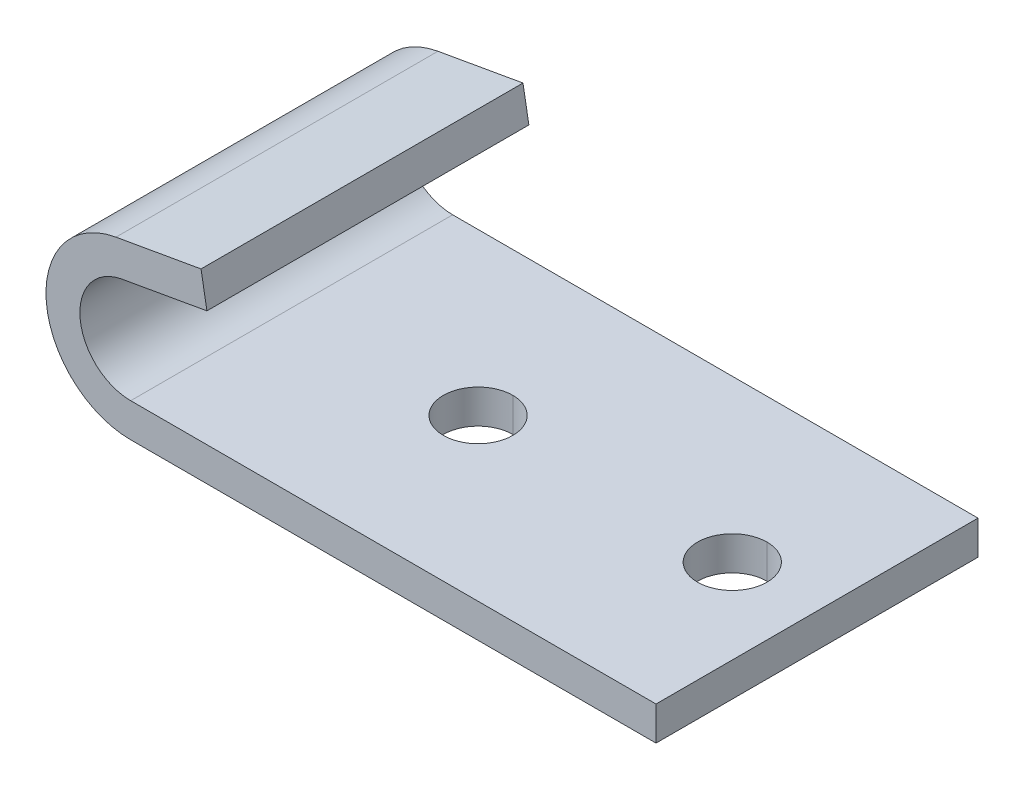
ISO-10303-21;
HEADER;
FILE_DESCRIPTION(('STEP AP214'),'2;1');
FILE_NAME('part.step','',(''),(''),'','','');
FILE_SCHEMA(('AUTOMOTIVE_DESIGN { 1 0 10303 214 1 1 1 1 }'));
ENDSEC;
DATA;
#1=APPLICATION_CONTEXT('core data for automotive mechanical design processes');
#2=APPLICATION_PROTOCOL_DEFINITION('international standard','automotive_design',2000,#1);
#3=PRODUCT_CONTEXT('',#1,'mechanical');
#4=PRODUCT('Part','Part','',(#3));
#5=PRODUCT_RELATED_PRODUCT_CATEGORY('part','',(#4));
#6=PRODUCT_DEFINITION_FORMATION('','',#4);
#7=PRODUCT_DEFINITION_CONTEXT('part definition',#1,'design');
#8=PRODUCT_DEFINITION('design','',#6,#7);
#9=PRODUCT_DEFINITION_SHAPE('','',#8);
#10=(LENGTH_UNIT() NAMED_UNIT(*) SI_UNIT(.MILLI.,.METRE.));
#11=(NAMED_UNIT(*) PLANE_ANGLE_UNIT() SI_UNIT($,.RADIAN.));
#12=(NAMED_UNIT(*) SI_UNIT($,.STERADIAN.) SOLID_ANGLE_UNIT());
#13=UNCERTAINTY_MEASURE_WITH_UNIT(LENGTH_MEASURE(1.E-05),#10,'distance_accuracy_value','');
#14=(GEOMETRIC_REPRESENTATION_CONTEXT(3) GLOBAL_UNCERTAINTY_ASSIGNED_CONTEXT((#13)) GLOBAL_UNIT_ASSIGNED_CONTEXT((#10,
#11,#12)) REPRESENTATION_CONTEXT('',''));
#15=CARTESIAN_POINT('',(0.,0.,0.));
#16=DIRECTION('',(0.,0.,1.));
#17=DIRECTION('',(1.,0.,0.));
#18=AXIS2_PLACEMENT_3D('',#15,#16,#17);
#19=CARTESIAN_POINT('',(20.150422440742,-1.1899254188708,9.5));
#20=DIRECTION('',(0.173859402032216,-0.984770485100463,0.));
#21=DIRECTION('',(0.984770485100463,0.173859402032216,0.));
#22=AXIS2_PLACEMENT_3D('',#19,#20,#21);
#23=PLANE('',#22);
#24=DIRECTION('',(-0.984770485100463,-0.173859402032216,0.));
#25=VECTOR('',#24,1.);
#26=CARTESIAN_POINT('',(20.150422440742,-1.1899254188708,-9.5));
#27=LINE('',#26,#25);
#28=CARTESIAN_POINT('',(20.150422440742,-1.1899254188708,-9.5));
#29=VERTEX_POINT('',#28);
#30=CARTESIAN_POINT('',(15.130702989839,-2.0761475744977,-9.5));
#31=VERTEX_POINT('',#30);
#32=EDGE_CURVE('E10',#29,#31,#27,.T.);
#33=ORIENTED_EDGE('',*,*,#32,.T.);
#34=DIRECTION('',(0.,0.,-1.));
#35=VECTOR('',#34,1.);
#36=CARTESIAN_POINT('',(15.130702989839,-2.0761475744977,9.5));
#37=LINE('',#36,#35);
#38=CARTESIAN_POINT('',(15.130702989839,-2.0761475744977,9.5));
#39=VERTEX_POINT('',#38);
#40=EDGE_CURVE('E23',#39,#31,#37,.T.);
#41=ORIENTED_EDGE('',*,*,#40,.F.);
#42=DIRECTION('',(-0.984770485100463,-0.173859402032216,0.));
#43=VECTOR('',#42,1.);
#44=CARTESIAN_POINT('',(20.150422440742,-1.1899254188708,9.5));
#45=LINE('',#44,#43);
#46=CARTESIAN_POINT('',(20.150422440742,-1.1899254188708,9.5));
#47=VERTEX_POINT('',#46);
#48=EDGE_CURVE('E229',#47,#39,#45,.T.);
#49=ORIENTED_EDGE('',*,*,#48,.F.);
#50=DIRECTION('',(0.,0.,-1.));
#51=VECTOR('',#50,1.);
#52=CARTESIAN_POINT('',(20.150422440742,-1.1899254188708,9.5));
#53=LINE('',#52,#51);
#54=EDGE_CURVE('E225',#47,#29,#53,.T.);
#55=ORIENTED_EDGE('',*,*,#54,.T.);
#56=EDGE_LOOP('',(#33,#41,#49,#55));
#57=FACE_BOUND('',#56,.T.);
#58=ADVANCED_FACE('F15',(#57),#23,.F.);
#59=CARTESIAN_POINT('',(20.497718804064,-3.1595409702009,9.5));
#60=DIRECTION('',(-0.984807753012249,-0.1736481776667,0.));
#61=DIRECTION('',(0.1736481776667,-0.984807753012249,0.));
#62=AXIS2_PLACEMENT_3D('',#59,#60,#61);
#63=PLANE('',#62);
#64=DIRECTION('',(-0.173648177666701,0.984807753012249,0.));
#65=VECTOR('',#64,1.);
#66=CARTESIAN_POINT('',(20.497718804064,-3.1595409702009,-9.5));
#67=LINE('',#66,#65);
#68=CARTESIAN_POINT('',(20.497718804064,-3.1595409702009,-9.5));
#69=VERTEX_POINT('',#68);
#70=EDGE_CURVE('E220',#69,#29,#67,.T.);
#71=ORIENTED_EDGE('',*,*,#70,.T.);
#72=ORIENTED_EDGE('',*,*,#54,.F.);
#73=DIRECTION('',(-0.173648177666701,0.984807753012249,0.));
#74=VECTOR('',#73,1.);
#75=CARTESIAN_POINT('',(20.497718804064,-3.1595409702009,9.5));
#76=LINE('',#75,#74);
#77=CARTESIAN_POINT('',(20.497718804064,-3.1595409702009,9.5));
#78=VERTEX_POINT('',#77);
#79=EDGE_CURVE('E215',#78,#47,#76,.T.);
#80=ORIENTED_EDGE('',*,*,#79,.F.);
#81=DIRECTION('',(0.,0.,-1.));
#82=VECTOR('',#81,1.);
#83=CARTESIAN_POINT('',(20.497718804064,-3.1595409702009,9.5));
#84=LINE('',#83,#82);
#85=EDGE_CURVE('E211',#78,#69,#84,.T.);
#86=ORIENTED_EDGE('',*,*,#85,.T.);
#87=EDGE_LOOP('',(#71,#72,#80,#86));
#88=FACE_BOUND('',#87,.T.);
#89=ADVANCED_FACE('F243',(#88),#63,.F.);
#90=CARTESIAN_POINT('',(15.478421793903,-4.0456885446986,9.5));
#91=DIRECTION('',(-0.17385940203222,0.984770485100462,0.));
#92=DIRECTION('',(-0.984770485100462,-0.17385940203222,0.));
#93=AXIS2_PLACEMENT_3D('',#90,#91,#92);
#94=PLANE('',#93);
#95=DIRECTION('',(0.984770485100462,0.17385940203222,0.));
#96=VECTOR('',#95,1.);
#97=CARTESIAN_POINT('',(15.478421793903,-4.0456885446986,-9.5));
#98=LINE('',#97,#96);
#99=CARTESIAN_POINT('',(15.478421793903,-4.0456885446986,-9.5));
#100=VERTEX_POINT('',#99);
#101=EDGE_CURVE('E206',#100,#69,#98,.T.);
#102=ORIENTED_EDGE('',*,*,#101,.T.);
#103=ORIENTED_EDGE('',*,*,#85,.F.);
#104=DIRECTION('',(0.984770485100462,0.17385940203222,0.));
#105=VECTOR('',#104,1.);
#106=CARTESIAN_POINT('',(15.478421793903,-4.0456885446986,9.5));
#107=LINE('',#106,#105);
#108=CARTESIAN_POINT('',(15.478421793903,-4.0456885446986,9.5));
#109=VERTEX_POINT('',#108);
#110=EDGE_CURVE('E201',#109,#78,#107,.T.);
#111=ORIENTED_EDGE('',*,*,#110,.F.);
#112=DIRECTION('',(0.,0.,-1.));
#113=VECTOR('',#112,1.);
#114=CARTESIAN_POINT('',(15.478421793903,-4.0456885446986,9.5));
#115=LINE('',#114,#113);
#116=EDGE_CURVE('E197',#109,#100,#115,.T.);
#117=ORIENTED_EDGE('',*,*,#116,.T.);
#118=EDGE_LOOP('',(#102,#103,#111,#117));
#119=FACE_BOUND('',#118,.T.);
#120=ADVANCED_FACE('F248',(#119),#94,.F.);
#121=CARTESIAN_POINT('',(15.9999999999997,-7.,9.5));
#122=DIRECTION('',(0.,0.,-1.));
#123=DIRECTION('',(0.996185346118096,0.0872625703241038,0.));
#124=AXIS2_PLACEMENT_3D('',#121,#122,#123);
#125=CYLINDRICAL_SURFACE('',#124,3.);
#126=CARTESIAN_POINT('',(15.9999999999997,-7.,-9.5));
#127=DIRECTION('',(0.,0.,1.));
#128=DIRECTION('',(1.,0.,0.));
#129=AXIS2_PLACEMENT_3D('',#126,#127,#128);
#130=CIRCLE('',#129,3.);
#131=CARTESIAN_POINT('',(16.,-10.,-9.5));
#132=VERTEX_POINT('',#131);
#133=EDGE_CURVE('E192',#100,#132,#130,.T.);
#134=ORIENTED_EDGE('',*,*,#133,.F.);
#135=ORIENTED_EDGE('',*,*,#116,.F.);
#136=CARTESIAN_POINT('',(15.9999999999997,-7.,9.5));
#137=DIRECTION('',(0.,0.,1.));
#138=DIRECTION('',(1.,0.,0.));
#139=AXIS2_PLACEMENT_3D('',#136,#137,#138);
#140=CIRCLE('',#139,3.);
#141=CARTESIAN_POINT('',(16.,-10.,9.5));
#142=VERTEX_POINT('',#141);
#143=EDGE_CURVE('E188',#109,#142,#140,.T.);
#144=ORIENTED_EDGE('',*,*,#143,.T.);
#145=DIRECTION('',(0.,0.,-1.));
#146=VECTOR('',#145,1.);
#147=CARTESIAN_POINT('',(16.,-10.,9.5));
#148=LINE('',#147,#146);
#149=EDGE_CURVE('E184',#142,#132,#148,.T.);
#150=ORIENTED_EDGE('',*,*,#149,.T.);
#151=EDGE_LOOP('',(#134,#135,#144,#150));
#152=FACE_BOUND('',#151,.T.);
#153=ADVANCED_FACE('F252',(#152),#125,.F.);
#154=CARTESIAN_POINT('',(47.,-10.,9.5));
#155=DIRECTION('',(0.,-1.,0.));
#156=DIRECTION('',(0.,0.,-1.));
#157=AXIS2_PLACEMENT_3D('',#154,#155,#156);
#158=PLANE('',#157);
#159=CARTESIAN_POINT('',(27.,-10.,0.));
#160=DIRECTION('',(0.,-1.,0.));
#161=DIRECTION('',(0.,0.,-1.));
#162=AXIS2_PLACEMENT_3D('',#159,#160,#161);
#163=CIRCLE('',#162,2.05);
#164=CARTESIAN_POINT('',(27.,-10.,-2.05));
#165=VERTEX_POINT('',#164);
#166=CARTESIAN_POINT('',(27.,-10.,2.05));
#167=VERTEX_POINT('',#166);
#168=EDGE_CURVE('E180',#165,#167,#163,.T.);
#169=ORIENTED_EDGE('',*,*,#168,.T.);
#170=CARTESIAN_POINT('',(27.,-10.,0.));
#171=DIRECTION('',(0.,-1.,0.));
#172=DIRECTION('',(0.,0.,-1.));
#173=AXIS2_PLACEMENT_3D('',#170,#171,#172);
#174=CIRCLE('',#173,2.05);
#175=EDGE_CURVE('E176',#167,#165,#174,.T.);
#176=ORIENTED_EDGE('',*,*,#175,.T.);
#177=EDGE_LOOP('',(#169,#176));
#178=FACE_BOUND('',#177,.T.);
#179=CARTESIAN_POINT('',(42.,-10.,0.));
#180=DIRECTION('',(0.,-1.,0.));
#181=DIRECTION('',(0.,0.,-1.));
#182=AXIS2_PLACEMENT_3D('',#179,#180,#181);
#183=CIRCLE('',#182,2.05);
#184=CARTESIAN_POINT('',(42.,-10.,-2.05));
#185=VERTEX_POINT('',#184);
#186=CARTESIAN_POINT('',(42.,-10.,2.05));
#187=VERTEX_POINT('',#186);
#188=EDGE_CURVE('E172',#185,#187,#183,.T.);
#189=ORIENTED_EDGE('',*,*,#188,.T.);
#190=CARTESIAN_POINT('',(42.,-10.,0.));
#191=DIRECTION('',(0.,-1.,0.));
#192=DIRECTION('',(0.,0.,-1.));
#193=AXIS2_PLACEMENT_3D('',#190,#191,#192);
#194=CIRCLE('',#193,2.05);
#195=EDGE_CURVE('E168',#187,#185,#194,.T.);
#196=ORIENTED_EDGE('',*,*,#195,.T.);
#197=EDGE_LOOP('',(#189,#196));
#198=FACE_BOUND('',#197,.T.);
#199=DIRECTION('',(-1.,0.,0.));
#200=VECTOR('',#199,1.);
#201=CARTESIAN_POINT('',(47.,-10.,-9.5));
#202=LINE('',#201,#200);
#203=CARTESIAN_POINT('',(47.,-10.,-9.5));
#204=VERTEX_POINT('',#203);
#205=EDGE_CURVE('E163',#204,#132,#202,.T.);
#206=ORIENTED_EDGE('',*,*,#205,.T.);
#207=ORIENTED_EDGE('',*,*,#149,.F.);
#208=DIRECTION('',(-1.,0.,0.));
#209=VECTOR('',#208,1.);
#210=CARTESIAN_POINT('',(47.,-10.,9.5));
#211=LINE('',#210,#209);
#212=CARTESIAN_POINT('',(47.,-10.,9.5));
#213=VERTEX_POINT('',#212);
#214=EDGE_CURVE('E158',#213,#142,#211,.T.);
#215=ORIENTED_EDGE('',*,*,#214,.F.);
#216=DIRECTION('',(0.,0.,-1.));
#217=VECTOR('',#216,1.);
#218=CARTESIAN_POINT('',(47.,-10.,9.5));
#219=LINE('',#218,#217);
#220=EDGE_CURVE('E154',#213,#204,#219,.T.);
#221=ORIENTED_EDGE('',*,*,#220,.T.);
#222=EDGE_LOOP('',(#206,#207,#215,#221));
#223=FACE_BOUND('',#222,.T.);
#224=ADVANCED_FACE('F255',(#178,#198,#223),#158,.F.);
#225=CARTESIAN_POINT('',(47.,-12.,9.5));
#226=DIRECTION('',(-1.,0.,0.));
#227=DIRECTION('',(0.,0.,1.));
#228=AXIS2_PLACEMENT_3D('',#225,#226,#227);
#229=PLANE('',#228);
#230=DIRECTION('',(0.,1.,0.));
#231=VECTOR('',#230,1.);
#232=CARTESIAN_POINT('',(47.,-12.,-9.5));
#233=LINE('',#232,#231);
#234=CARTESIAN_POINT('',(47.,-12.,-9.5));
#235=VERTEX_POINT('',#234);
#236=EDGE_CURVE('E120',#235,#204,#233,.T.);
#237=ORIENTED_EDGE('',*,*,#236,.T.);
#238=ORIENTED_EDGE('',*,*,#220,.F.);
#239=DIRECTION('',(0.,1.,0.));
#240=VECTOR('',#239,1.);
#241=CARTESIAN_POINT('',(47.,-12.,9.5));
#242=LINE('',#241,#240);
#243=CARTESIAN_POINT('',(47.,-12.,9.5));
#244=VERTEX_POINT('',#243);
#245=EDGE_CURVE('E146',#244,#213,#242,.T.);
#246=ORIENTED_EDGE('',*,*,#245,.F.);
#247=DIRECTION('',(0.,0.,-1.));
#248=VECTOR('',#247,1.);
#249=CARTESIAN_POINT('',(47.,-12.,9.5));
#250=LINE('',#249,#248);
#251=EDGE_CURVE('E142',#244,#235,#250,.T.);
#252=ORIENTED_EDGE('',*,*,#251,.T.);
#253=EDGE_LOOP('',(#237,#238,#246,#252));
#254=FACE_BOUND('',#253,.T.);
#255=ADVANCED_FACE('F258',(#254),#229,.F.);
#256=CARTESIAN_POINT('',(16.,-12.,9.5));
#257=DIRECTION('',(0.,1.,0.));
#258=DIRECTION('',(0.,0.,1.));
#259=AXIS2_PLACEMENT_3D('',#256,#257,#258);
#260=PLANE('',#259);
#261=CARTESIAN_POINT('',(27.,-12.,0.));
#262=DIRECTION('',(0.,1.,0.));
#263=DIRECTION('',(0.,0.,1.));
#264=AXIS2_PLACEMENT_3D('',#261,#262,#263);
#265=CIRCLE('',#264,2.05);
#266=CARTESIAN_POINT('',(27.,-12.,2.05));
#267=VERTEX_POINT('',#266);
#268=CARTESIAN_POINT('',(27.,-12.,-2.05));
#269=VERTEX_POINT('',#268);
#270=EDGE_CURVE('E138',#267,#269,#265,.T.);
#271=ORIENTED_EDGE('',*,*,#270,.T.);
#272=CARTESIAN_POINT('',(27.,-12.,0.));
#273=DIRECTION('',(0.,1.,0.));
#274=DIRECTION('',(0.,0.,1.));
#275=AXIS2_PLACEMENT_3D('',#272,#273,#274);
#276=CIRCLE('',#275,2.05);
#277=EDGE_CURVE('E134',#269,#267,#276,.T.);
#278=ORIENTED_EDGE('',*,*,#277,.T.);
#279=EDGE_LOOP('',(#271,#278));
#280=FACE_BOUND('',#279,.T.);
#281=CARTESIAN_POINT('',(42.,-12.,0.));
#282=DIRECTION('',(0.,1.,0.));
#283=DIRECTION('',(0.,0.,1.));
#284=AXIS2_PLACEMENT_3D('',#281,#282,#283);
#285=CIRCLE('',#284,2.05);
#286=CARTESIAN_POINT('',(42.,-12.,2.05));
#287=VERTEX_POINT('',#286);
#288=CARTESIAN_POINT('',(42.,-12.,-2.05));
#289=VERTEX_POINT('',#288);
#290=EDGE_CURVE('E123',#287,#289,#285,.T.);
#291=ORIENTED_EDGE('',*,*,#290,.T.);
#292=CARTESIAN_POINT('',(42.,-12.,0.));
#293=DIRECTION('',(0.,1.,0.));
#294=DIRECTION('',(0.,0.,1.));
#295=AXIS2_PLACEMENT_3D('',#292,#293,#294);
#296=CIRCLE('',#295,2.05);
#297=EDGE_CURVE('E121',#289,#287,#296,.T.);
#298=ORIENTED_EDGE('',*,*,#297,.T.);
#299=EDGE_LOOP('',(#291,#298));
#300=FACE_BOUND('',#299,.T.);
#301=DIRECTION('',(1.,0.,0.));
#302=VECTOR('',#301,1.);
#303=CARTESIAN_POINT('',(16.,-12.,-9.5));
#304=LINE('',#303,#302);
#305=CARTESIAN_POINT('',(16.,-12.,-9.5));
#306=VERTEX_POINT('',#305);
#307=EDGE_CURVE('E105',#306,#235,#304,.T.);
#308=ORIENTED_EDGE('',*,*,#307,.T.);
#309=ORIENTED_EDGE('',*,*,#251,.F.);
#310=DIRECTION('',(1.,0.,0.));
#311=VECTOR('',#310,1.);
#312=CARTESIAN_POINT('',(16.,-12.,9.5));
#313=LINE('',#312,#311);
#314=CARTESIAN_POINT('',(16.,-12.,9.5));
#315=VERTEX_POINT('',#314);
#316=EDGE_CURVE('E108',#315,#244,#313,.T.);
#317=ORIENTED_EDGE('',*,*,#316,.F.);
#318=DIRECTION('',(0.,0.,-1.));
#319=VECTOR('',#318,1.);
#320=CARTESIAN_POINT('',(16.,-12.,9.5));
#321=LINE('',#320,#319);
#322=EDGE_CURVE('E100',#315,#306,#321,.T.);
#323=ORIENTED_EDGE('',*,*,#322,.T.);
#324=EDGE_LOOP('',(#308,#309,#317,#323));
#325=FACE_BOUND('',#324,.T.);
#326=ADVANCED_FACE('F102',(#280,#300,#325),#260,.F.);
#327=CARTESIAN_POINT('',(16.,-7.,9.5));
#328=DIRECTION('',(0.,0.,-1.));
#329=DIRECTION('',(0.996185346118102,0.0872625703240375,0.));
#330=AXIS2_PLACEMENT_3D('',#327,#328,#329);
#331=CYLINDRICAL_SURFACE('',#330,5.);
#332=CARTESIAN_POINT('',(16.,-7.,-9.5));
#333=DIRECTION('',(0.,0.,1.));
#334=DIRECTION('',(1.,0.,0.));
#335=AXIS2_PLACEMENT_3D('',#332,#333,#334);
#336=CIRCLE('',#335,5.);
#337=EDGE_CURVE('E111',#31,#306,#336,.T.);
#338=ORIENTED_EDGE('',*,*,#337,.T.);
#339=ORIENTED_EDGE('',*,*,#322,.F.);
#340=CARTESIAN_POINT('',(16.,-7.,9.5));
#341=DIRECTION('',(0.,0.,1.));
#342=DIRECTION('',(1.,0.,0.));
#343=AXIS2_PLACEMENT_3D('',#340,#341,#342);
#344=CIRCLE('',#343,5.);
#345=EDGE_CURVE('E115',#39,#315,#344,.T.);
#346=ORIENTED_EDGE('',*,*,#345,.F.);
#347=ORIENTED_EDGE('',*,*,#40,.T.);
#348=EDGE_LOOP('',(#338,#339,#346,#347));
#349=FACE_BOUND('',#348,.T.);
#350=ADVANCED_FACE('F113',(#349),#331,.T.);
#351=CARTESIAN_POINT('',(16.,-7.,9.5));
#352=DIRECTION('',(0.,0.,1.));
#353=DIRECTION('',(1.,0.,0.));
#354=AXIS2_PLACEMENT_3D('',#351,#352,#353);
#355=PLANE('',#354);
#356=ORIENTED_EDGE('',*,*,#48,.T.);
#357=ORIENTED_EDGE('',*,*,#345,.T.);
#358=ORIENTED_EDGE('',*,*,#316,.T.);
#359=ORIENTED_EDGE('',*,*,#245,.T.);
#360=ORIENTED_EDGE('',*,*,#214,.T.);
#361=ORIENTED_EDGE('',*,*,#143,.F.);
#362=ORIENTED_EDGE('',*,*,#110,.T.);
#363=ORIENTED_EDGE('',*,*,#79,.T.);
#364=EDGE_LOOP('',(#356,#357,#358,#359,#360,#361,#362,#363));
#365=FACE_BOUND('',#364,.T.);
#366=ADVANCED_FACE('F239',(#365),#355,.T.);
#367=CARTESIAN_POINT('',(16.,-7.,-9.5));
#368=DIRECTION('',(0.,0.,1.));
#369=DIRECTION('',(1.,0.,0.));
#370=AXIS2_PLACEMENT_3D('',#367,#368,#369);
#371=PLANE('',#370);
#372=ORIENTED_EDGE('',*,*,#32,.F.);
#373=ORIENTED_EDGE('',*,*,#70,.F.);
#374=ORIENTED_EDGE('',*,*,#101,.F.);
#375=ORIENTED_EDGE('',*,*,#133,.T.);
#376=ORIENTED_EDGE('',*,*,#205,.F.);
#377=ORIENTED_EDGE('',*,*,#236,.F.);
#378=ORIENTED_EDGE('',*,*,#307,.F.);
#379=ORIENTED_EDGE('',*,*,#337,.F.);
#380=EDGE_LOOP('',(#372,#373,#374,#375,#376,#377,#378,#379));
#381=FACE_BOUND('',#380,.T.);
#382=ADVANCED_FACE('F117',(#381),#371,.F.);
#383=CARTESIAN_POINT('',(42.,-15.,0.));
#384=DIRECTION('',(0.,1.,0.));
#385=DIRECTION('',(1.,0.,0.));
#386=AXIS2_PLACEMENT_3D('',#383,#384,#385);
#387=CYLINDRICAL_SURFACE('',#386,2.05);
#388=DIRECTION('',(0.,1.,0.));
#389=VECTOR('',#388,1.);
#390=CARTESIAN_POINT('',(42.,-12.,-2.05));
#391=LINE('',#390,#389);
#392=EDGE_CURVE('E431',#289,#185,#391,.T.);
#393=ORIENTED_EDGE('',*,*,#392,.T.);
#394=ORIENTED_EDGE('',*,*,#195,.F.);
#395=DIRECTION('',(0.,1.,0.));
#396=VECTOR('',#395,1.);
#397=CARTESIAN_POINT('',(42.,-12.,2.05));
#398=LINE('',#397,#396);
#399=EDGE_CURVE('E427',#287,#187,#398,.T.);
#400=ORIENTED_EDGE('',*,*,#399,.F.);
#401=ORIENTED_EDGE('',*,*,#297,.F.);
#402=EDGE_LOOP('',(#393,#394,#400,#401));
#403=FACE_BOUND('',#402,.T.);
#404=ADVANCED_FACE('F334',(#403),#387,.F.);
#405=CARTESIAN_POINT('',(42.,-15.,0.));
#406=DIRECTION('',(0.,1.,0.));
#407=DIRECTION('',(-1.,0.,0.));
#408=AXIS2_PLACEMENT_3D('',#405,#406,#407);
#409=CYLINDRICAL_SURFACE('',#408,2.05);
#410=ORIENTED_EDGE('',*,*,#392,.F.);
#411=ORIENTED_EDGE('',*,*,#290,.F.);
#412=ORIENTED_EDGE('',*,*,#399,.T.);
#413=ORIENTED_EDGE('',*,*,#188,.F.);
#414=EDGE_LOOP('',(#410,#411,#412,#413));
#415=FACE_BOUND('',#414,.T.);
#416=ADVANCED_FACE('F344',(#415),#409,.F.);
#417=CARTESIAN_POINT('',(27.,-15.,0.));
#418=DIRECTION('',(0.,1.,0.));
#419=DIRECTION('',(1.,0.,0.));
#420=AXIS2_PLACEMENT_3D('',#417,#418,#419);
#421=CYLINDRICAL_SURFACE('',#420,2.05);
#422=DIRECTION('',(0.,1.,0.));
#423=VECTOR('',#422,1.);
#424=CARTESIAN_POINT('',(27.,-12.,-2.05));
#425=LINE('',#424,#423);
#426=EDGE_CURVE('E422',#269,#165,#425,.T.);
#427=ORIENTED_EDGE('',*,*,#426,.T.);
#428=ORIENTED_EDGE('',*,*,#175,.F.);
#429=DIRECTION('',(0.,1.,0.));
#430=VECTOR('',#429,1.);
#431=CARTESIAN_POINT('',(27.,-12.,2.05));
#432=LINE('',#431,#430);
#433=EDGE_CURVE('E428',#267,#167,#432,.T.);
#434=ORIENTED_EDGE('',*,*,#433,.F.);
#435=ORIENTED_EDGE('',*,*,#277,.F.);
#436=EDGE_LOOP('',(#427,#428,#434,#435));
#437=FACE_BOUND('',#436,.T.);
#438=ADVANCED_FACE('F355',(#437),#421,.F.);
#439=CARTESIAN_POINT('',(27.,-15.,0.));
#440=DIRECTION('',(0.,1.,0.));
#441=DIRECTION('',(-1.,0.,0.));
#442=AXIS2_PLACEMENT_3D('',#439,#440,#441);
#443=CYLINDRICAL_SURFACE('',#442,2.05);
#444=ORIENTED_EDGE('',*,*,#426,.F.);
#445=ORIENTED_EDGE('',*,*,#270,.F.);
#446=ORIENTED_EDGE('',*,*,#433,.T.);
#447=ORIENTED_EDGE('',*,*,#168,.F.);
#448=EDGE_LOOP('',(#444,#445,#446,#447));
#449=FACE_BOUND('',#448,.T.);
#450=ADVANCED_FACE('F366',(#449),#443,.F.);
#451=CLOSED_SHELL('',(#58,#89,#120,#153,#224,#255,#326,#350,#366,#382,#404,#416,#438,#450));
#452=MANIFOLD_SOLID_BREP('B1',#451);
#453=ADVANCED_BREP_SHAPE_REPRESENTATION('',(#18,#452),#14);
#454=SHAPE_DEFINITION_REPRESENTATION(#9,#453);
ENDSEC;
END-ISO-10303-21;
